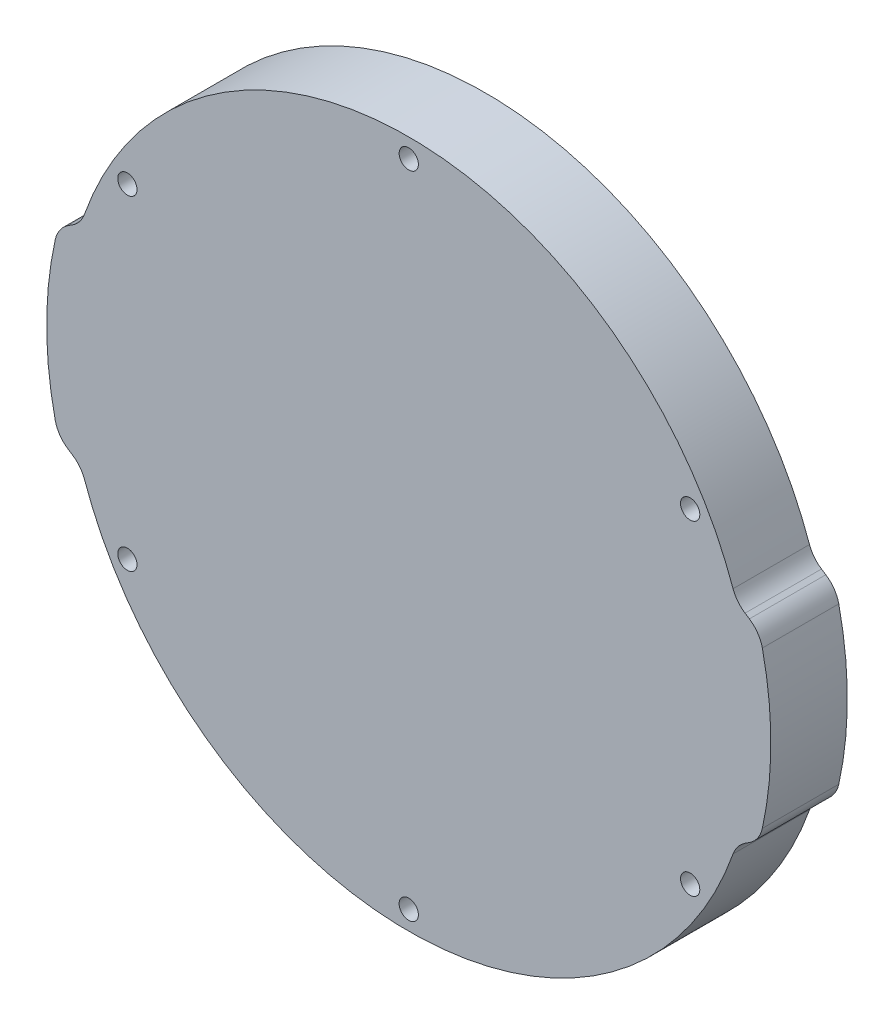
ISO-10303-21;
HEADER;
FILE_DESCRIPTION(('STEP AP214'),'2;1');
FILE_NAME('part.step','',(''),(''),'','','');
FILE_SCHEMA(('AUTOMOTIVE_DESIGN { 1 0 10303 214 1 1 1 1 }'));
ENDSEC;
DATA;
#1=APPLICATION_CONTEXT('core data for automotive mechanical design processes');
#2=APPLICATION_PROTOCOL_DEFINITION('international standard','automotive_design',2000,#1);
#3=PRODUCT_CONTEXT('',#1,'mechanical');
#4=PRODUCT('Part','Part','',(#3));
#5=PRODUCT_RELATED_PRODUCT_CATEGORY('part','',(#4));
#6=PRODUCT_DEFINITION_FORMATION('','',#4);
#7=PRODUCT_DEFINITION_CONTEXT('part definition',#1,'design');
#8=PRODUCT_DEFINITION('design','',#6,#7);
#9=PRODUCT_DEFINITION_SHAPE('','',#8);
#10=(LENGTH_UNIT() NAMED_UNIT(*) SI_UNIT(.MILLI.,.METRE.));
#11=(NAMED_UNIT(*) PLANE_ANGLE_UNIT() SI_UNIT($,.RADIAN.));
#12=(NAMED_UNIT(*) SI_UNIT($,.STERADIAN.) SOLID_ANGLE_UNIT());
#13=UNCERTAINTY_MEASURE_WITH_UNIT(LENGTH_MEASURE(1.E-05),#10,'distance_accuracy_value','');
#14=(GEOMETRIC_REPRESENTATION_CONTEXT(3) GLOBAL_UNCERTAINTY_ASSIGNED_CONTEXT((#13)) GLOBAL_UNIT_ASSIGNED_CONTEXT((#10,
#11,#12)) REPRESENTATION_CONTEXT('',''));
#15=CARTESIAN_POINT('',(0.,0.,0.));
#16=DIRECTION('',(0.,0.,1.));
#17=DIRECTION('',(1.,0.,0.));
#18=AXIS2_PLACEMENT_3D('',#15,#16,#17);
#19=CARTESIAN_POINT('',(0.,0.,12.7));
#20=DIRECTION('',(0.,0.,-1.));
#21=DIRECTION('',(-1.,0.,0.));
#22=AXIS2_PLACEMENT_3D('',#19,#20,#21);
#23=PLANE('',#22);
#24=CARTESIAN_POINT('',(5.42327943909187E-12,-53.975,12.7));
#25=DIRECTION('',(0.,0.,1.));
#26=DIRECTION('',(1.,0.,0.));
#27=AXIS2_PLACEMENT_3D('',#24,#25,#26);
#28=CIRCLE('',#27,1.6);
#29=CARTESIAN_POINT('',(1.60000000000542,-53.975,12.7));
#30=VERTEX_POINT('',#29);
#31=EDGE_CURVE('E497',#30,#30,#28,.T.);
#32=ORIENTED_EDGE('',*,*,#31,.F.);
#33=EDGE_LOOP('',(#32));
#34=FACE_BOUND('',#33,.T.);
#35=CARTESIAN_POINT('',(46.7437211692664,26.9875000000024,12.7));
#36=DIRECTION('',(0.,0.,1.));
#37=DIRECTION('',(1.,0.,0.));
#38=AXIS2_PLACEMENT_3D('',#35,#36,#37);
#39=CIRCLE('',#38,1.60000000000001);
#40=CARTESIAN_POINT('',(48.3437211692664,26.9875000000024,12.7));
#41=VERTEX_POINT('',#40);
#42=EDGE_CURVE('E313',#41,#41,#39,.T.);
#43=ORIENTED_EDGE('',*,*,#42,.F.);
#44=EDGE_LOOP('',(#43));
#45=FACE_BOUND('',#44,.T.);
#46=CARTESIAN_POINT('',(0.,53.975,12.7));
#47=DIRECTION('',(0.,0.,1.));
#48=DIRECTION('',(1.,0.,0.));
#49=AXIS2_PLACEMENT_3D('',#46,#47,#48);
#50=CIRCLE('',#49,1.6);
#51=CARTESIAN_POINT('',(1.6,53.975,12.7));
#52=VERTEX_POINT('',#51);
#53=EDGE_CURVE('E319',#52,#52,#50,.T.);
#54=ORIENTED_EDGE('',*,*,#53,.F.);
#55=EDGE_LOOP('',(#54));
#56=FACE_BOUND('',#55,.T.);
#57=CARTESIAN_POINT('',(0.,0.,12.7));
#58=DIRECTION('',(0.,0.,1.));
#59=DIRECTION('',(-1.,0.,0.));
#60=AXIS2_PLACEMENT_3D('',#57,#58,#59);
#61=CIRCLE('',#60,60.15);
#62=CARTESIAN_POINT('',(58.7341357738568,-12.97396604351,12.7));
#63=VERTEX_POINT('',#62);
#64=CARTESIAN_POINT('',(58.7341357738568,12.97396604351,12.7));
#65=VERTEX_POINT('',#64);
#66=EDGE_CURVE('E218',#63,#65,#61,.T.);
#67=ORIENTED_EDGE('',*,*,#66,.T.);
#68=CARTESIAN_POINT('',(53.8518302232453,11.8954983757203,12.7));
#69=DIRECTION('',(0.,0.,-1.));
#70=DIRECTION('',(-1.,0.,0.));
#71=AXIS2_PLACEMENT_3D('',#68,#69,#70);
#72=CIRCLE('',#71,5.);
#73=CARTESIAN_POINT('',(56.5773734681787,16.0873254260645,12.7));
#74=VERTEX_POINT('',#73);
#75=EDGE_CURVE('E255',#65,#74,#72,.F.);
#76=ORIENTED_EDGE('',*,*,#75,.T.);
#77=DIRECTION('',(-0.838365410068851,0.545108648986684,0.));
#78=VECTOR('',#77,1.);
#79=CARTESIAN_POINT('',(58.2496566513486,15.,12.7));
#80=LINE('',#79,#78);
#81=CARTESIAN_POINT('',(55.8597455361239,16.5539300686456,12.7));
#82=VERTEX_POINT('',#81);
#83=EDGE_CURVE('E344',#74,#82,#80,.T.);
#84=ORIENTED_EDGE('',*,*,#83,.T.);
#85=CARTESIAN_POINT('',(58.5852887810573,20.7457571189899,12.7));
#86=DIRECTION('',(0.,0.,-1.));
#87=DIRECTION('',(-1.,0.,0.));
#88=AXIS2_PLACEMENT_3D('',#85,#86,#87);
#89=CIRCLE('',#88,5.);
#90=CARTESIAN_POINT('',(53.87207166271,19.0767501102216,12.7));
#91=VERTEX_POINT('',#90);
#92=EDGE_CURVE('E171',#82,#91,#89,.T.);
#93=ORIENTED_EDGE('',*,*,#92,.T.);
#94=CARTESIAN_POINT('',(0.,0.,12.7));
#95=DIRECTION('',(0.,0.,1.));
#96=DIRECTION('',(1.,0.,0.));
#97=AXIS2_PLACEMENT_3D('',#94,#95,#96);
#98=CIRCLE('',#97,57.15);
#99=CARTESIAN_POINT('',(-53.87207166271,19.0767501102216,12.7));
#100=VERTEX_POINT('',#99);
#101=EDGE_CURVE('E181',#91,#100,#98,.T.);
#102=ORIENTED_EDGE('',*,*,#101,.T.);
#103=CARTESIAN_POINT('',(-58.5852887810573,20.7457571189899,12.7));
#104=DIRECTION('',(0.,0.,-1.));
#105=DIRECTION('',(-1.,0.,0.));
#106=AXIS2_PLACEMENT_3D('',#103,#104,#105);
#107=CIRCLE('',#106,5.);
#108=CARTESIAN_POINT('',(-55.8597455361239,16.5539300686456,12.7));
#109=VERTEX_POINT('',#108);
#110=EDGE_CURVE('E11',#100,#109,#107,.T.);
#111=ORIENTED_EDGE('',*,*,#110,.T.);
#112=DIRECTION('',(-0.838365410068851,-0.545108648986684,0.));
#113=VECTOR('',#112,1.);
#114=CARTESIAN_POINT('',(-58.2496566513486,15.,12.7));
#115=LINE('',#114,#113);
#116=CARTESIAN_POINT('',(-56.5773734681787,16.0873254260645,12.7));
#117=VERTEX_POINT('',#116);
#118=EDGE_CURVE('E305',#109,#117,#115,.T.);
#119=ORIENTED_EDGE('',*,*,#118,.T.);
#120=CARTESIAN_POINT('',(-53.8518302232453,11.8954983757203,12.7));
#121=DIRECTION('',(0.,0.,-1.));
#122=DIRECTION('',(-1.,0.,0.));
#123=AXIS2_PLACEMENT_3D('',#120,#121,#122);
#124=CIRCLE('',#123,5.);
#125=CARTESIAN_POINT('',(-58.7341357738568,12.97396604351,12.7));
#126=VERTEX_POINT('',#125);
#127=EDGE_CURVE('E246',#117,#126,#124,.F.);
#128=ORIENTED_EDGE('',*,*,#127,.T.);
#129=CARTESIAN_POINT('',(0.,0.,12.7));
#130=DIRECTION('',(0.,0.,1.));
#131=DIRECTION('',(1.,0.,0.));
#132=AXIS2_PLACEMENT_3D('',#129,#130,#131);
#133=CIRCLE('',#132,60.15);
#134=CARTESIAN_POINT('',(-58.7341357738568,-12.97396604351,12.7));
#135=VERTEX_POINT('',#134);
#136=EDGE_CURVE('E308',#126,#135,#133,.T.);
#137=ORIENTED_EDGE('',*,*,#136,.T.);
#138=CARTESIAN_POINT('',(-53.8518302232453,-11.8954983757203,12.7));
#139=DIRECTION('',(0.,0.,-1.));
#140=DIRECTION('',(-1.,0.,0.));
#141=AXIS2_PLACEMENT_3D('',#138,#139,#140);
#142=CIRCLE('',#141,5.);
#143=CARTESIAN_POINT('',(-56.5773734681787,-16.0873254260645,12.7));
#144=VERTEX_POINT('',#143);
#145=EDGE_CURVE('E249',#135,#144,#142,.F.);
#146=ORIENTED_EDGE('',*,*,#145,.T.);
#147=DIRECTION('',(0.838365410068851,-0.545108648986684,0.));
#148=VECTOR('',#147,1.);
#149=CARTESIAN_POINT('',(-58.2496566513486,-15.,12.7));
#150=LINE('',#149,#148);
#151=CARTESIAN_POINT('',(-55.8597455361239,-16.5539300686456,12.7));
#152=VERTEX_POINT('',#151);
#153=EDGE_CURVE('E353',#144,#152,#150,.T.);
#154=ORIENTED_EDGE('',*,*,#153,.T.);
#155=CARTESIAN_POINT('',(-58.5852887810573,-20.7457571189899,12.7));
#156=DIRECTION('',(0.,0.,-1.));
#157=DIRECTION('',(-1.,0.,0.));
#158=AXIS2_PLACEMENT_3D('',#155,#156,#157);
#159=CIRCLE('',#158,5.);
#160=CARTESIAN_POINT('',(-53.87207166271,-19.0767501102216,12.7));
#161=VERTEX_POINT('',#160);
#162=EDGE_CURVE('E300',#152,#161,#159,.T.);
#163=ORIENTED_EDGE('',*,*,#162,.T.);
#164=CARTESIAN_POINT('',(0.,0.,12.7));
#165=DIRECTION('',(0.,0.,1.));
#166=DIRECTION('',(1.,0.,0.));
#167=AXIS2_PLACEMENT_3D('',#164,#165,#166);
#168=CIRCLE('',#167,57.15);
#169=CARTESIAN_POINT('',(53.87207166271,-19.0767501102216,12.7));
#170=VERTEX_POINT('',#169);
#171=EDGE_CURVE('E357',#161,#170,#168,.T.);
#172=ORIENTED_EDGE('',*,*,#171,.T.);
#173=CARTESIAN_POINT('',(58.5852887810573,-20.7457571189899,12.7));
#174=DIRECTION('',(0.,0.,-1.));
#175=DIRECTION('',(-1.,0.,0.));
#176=AXIS2_PLACEMENT_3D('',#173,#174,#175);
#177=CIRCLE('',#176,5.);
#178=CARTESIAN_POINT('',(55.8597455361239,-16.5539300686456,12.7));
#179=VERTEX_POINT('',#178);
#180=EDGE_CURVE('E68',#170,#179,#177,.T.);
#181=ORIENTED_EDGE('',*,*,#180,.T.);
#182=DIRECTION('',(0.838365410068851,0.545108648986684,0.));
#183=VECTOR('',#182,1.);
#184=CARTESIAN_POINT('',(58.2496566513486,-15.,12.7));
#185=LINE('',#184,#183);
#186=CARTESIAN_POINT('',(56.5773734681787,-16.0873254260645,12.7));
#187=VERTEX_POINT('',#186);
#188=EDGE_CURVE('E220',#179,#187,#185,.T.);
#189=ORIENTED_EDGE('',*,*,#188,.T.);
#190=CARTESIAN_POINT('',(53.8518302232453,-11.8954983757203,12.7));
#191=DIRECTION('',(0.,0.,-1.));
#192=DIRECTION('',(-1.,0.,0.));
#193=AXIS2_PLACEMENT_3D('',#190,#191,#192);
#194=CIRCLE('',#193,5.);
#195=EDGE_CURVE('E252',#187,#63,#194,.F.);
#196=ORIENTED_EDGE('',*,*,#195,.T.);
#197=EDGE_LOOP('',(#67,#76,#84,#93,#102,#111,#119,#128,#137,#146,#154,#163,#172,#181,#189,#196));
#198=FACE_BOUND('',#197,.T.);
#199=CARTESIAN_POINT('',(-46.743721169261,-26.9875000000024,12.7));
#200=DIRECTION('',(0.,0.,1.));
#201=DIRECTION('',(1.,0.,0.));
#202=AXIS2_PLACEMENT_3D('',#199,#200,#201);
#203=CIRCLE('',#202,1.6);
#204=CARTESIAN_POINT('',(-45.143721169261,-26.9875000000024,12.7));
#205=VERTEX_POINT('',#204);
#206=EDGE_CURVE('E312',#205,#205,#203,.T.);
#207=ORIENTED_EDGE('',*,*,#206,.F.);
#208=EDGE_LOOP('',(#207));
#209=FACE_BOUND('',#208,.T.);
#210=CARTESIAN_POINT('',(46.7437211692692,-26.9874999999976,12.7));
#211=DIRECTION('',(0.,0.,1.));
#212=DIRECTION('',(1.,0.,0.));
#213=AXIS2_PLACEMENT_3D('',#210,#211,#212);
#214=CIRCLE('',#213,1.6);
#215=CARTESIAN_POINT('',(48.3437211692691,-26.9874999999976,12.7));
#216=VERTEX_POINT('',#215);
#217=EDGE_CURVE('E323',#216,#216,#214,.T.);
#218=ORIENTED_EDGE('',*,*,#217,.F.);
#219=EDGE_LOOP('',(#218));
#220=FACE_BOUND('',#219,.T.);
#221=CARTESIAN_POINT('',(-46.7437211692637,26.9874999999976,12.7));
#222=DIRECTION('',(0.,0.,1.));
#223=DIRECTION('',(1.,0.,0.));
#224=AXIS2_PLACEMENT_3D('',#221,#222,#223);
#225=CIRCLE('',#224,1.6);
#226=CARTESIAN_POINT('',(-45.1437211692637,26.9874999999976,12.7));
#227=VERTEX_POINT('',#226);
#228=EDGE_CURVE('E491',#227,#227,#225,.T.);
#229=ORIENTED_EDGE('',*,*,#228,.F.);
#230=EDGE_LOOP('',(#229));
#231=FACE_BOUND('',#230,.T.);
#232=ADVANCED_FACE('F45',(#34,#45,#56,#198,#209,#220,#231),#23,.F.);
#233=CARTESIAN_POINT('',(0.,0.,0.));
#234=DIRECTION('',(0.,0.,-1.));
#235=DIRECTION('',(-1.,0.,0.));
#236=AXIS2_PLACEMENT_3D('',#233,#234,#235);
#237=PLANE('',#236);
#238=CARTESIAN_POINT('',(5.42327943909187E-12,-53.975,0.));
#239=DIRECTION('',(0.,0.,1.));
#240=DIRECTION('',(1.,0.,0.));
#241=AXIS2_PLACEMENT_3D('',#238,#239,#240);
#242=CIRCLE('',#241,1.6);
#243=CARTESIAN_POINT('',(1.60000000000542,-53.975,0.));
#244=VERTEX_POINT('',#243);
#245=EDGE_CURVE('E494',#244,#244,#242,.T.);
#246=ORIENTED_EDGE('',*,*,#245,.T.);
#247=EDGE_LOOP('',(#246));
#248=FACE_BOUND('',#247,.T.);
#249=CARTESIAN_POINT('',(46.7437211692664,26.9875000000024,0.));
#250=DIRECTION('',(0.,0.,1.));
#251=DIRECTION('',(1.,0.,0.));
#252=AXIS2_PLACEMENT_3D('',#249,#250,#251);
#253=CIRCLE('',#252,1.60000000000001);
#254=CARTESIAN_POINT('',(48.3437211692664,26.9875000000024,0.));
#255=VERTEX_POINT('',#254);
#256=EDGE_CURVE('E321',#255,#255,#253,.T.);
#257=ORIENTED_EDGE('',*,*,#256,.T.);
#258=EDGE_LOOP('',(#257));
#259=FACE_BOUND('',#258,.T.);
#260=CARTESIAN_POINT('',(0.,53.975,0.));
#261=DIRECTION('',(0.,0.,1.));
#262=DIRECTION('',(1.,0.,0.));
#263=AXIS2_PLACEMENT_3D('',#260,#261,#262);
#264=CIRCLE('',#263,1.6);
#265=CARTESIAN_POINT('',(1.6,53.975,0.));
#266=VERTEX_POINT('',#265);
#267=EDGE_CURVE('E316',#266,#266,#264,.T.);
#268=ORIENTED_EDGE('',*,*,#267,.T.);
#269=EDGE_LOOP('',(#268));
#270=FACE_BOUND('',#269,.T.);
#271=DIRECTION('',(-0.838365410068851,0.545108648986684,0.));
#272=VECTOR('',#271,1.);
#273=CARTESIAN_POINT('',(58.2496566513486,15.,0.));
#274=LINE('',#273,#272);
#275=CARTESIAN_POINT('',(56.5773734681787,16.0873254260645,0.));
#276=VERTEX_POINT('',#275);
#277=CARTESIAN_POINT('',(55.8597455361239,16.5539300686456,0.));
#278=VERTEX_POINT('',#277);
#279=EDGE_CURVE('E191',#276,#278,#274,.T.);
#280=ORIENTED_EDGE('',*,*,#279,.F.);
#281=CARTESIAN_POINT('',(53.8518302232453,11.8954983757203,0.));
#282=DIRECTION('',(0.,0.,-1.));
#283=DIRECTION('',(-1.,0.,0.));
#284=AXIS2_PLACEMENT_3D('',#281,#282,#283);
#285=CIRCLE('',#284,5.);
#286=CARTESIAN_POINT('',(58.7341357738568,12.97396604351,0.));
#287=VERTEX_POINT('',#286);
#288=EDGE_CURVE('E236',#276,#287,#285,.T.);
#289=ORIENTED_EDGE('',*,*,#288,.T.);
#290=CARTESIAN_POINT('',(0.,0.,0.));
#291=DIRECTION('',(0.,0.,1.));
#292=DIRECTION('',(-1.,0.,0.));
#293=AXIS2_PLACEMENT_3D('',#290,#291,#292);
#294=CIRCLE('',#293,60.15);
#295=CARTESIAN_POINT('',(58.7341357738568,-12.97396604351,0.));
#296=VERTEX_POINT('',#295);
#297=EDGE_CURVE('E200',#296,#287,#294,.T.);
#298=ORIENTED_EDGE('',*,*,#297,.F.);
#299=CARTESIAN_POINT('',(53.8518302232453,-11.8954983757203,0.));
#300=DIRECTION('',(0.,0.,-1.));
#301=DIRECTION('',(-1.,0.,0.));
#302=AXIS2_PLACEMENT_3D('',#299,#300,#301);
#303=CIRCLE('',#302,5.);
#304=CARTESIAN_POINT('',(56.5773734681787,-16.0873254260645,0.));
#305=VERTEX_POINT('',#304);
#306=EDGE_CURVE('E233',#296,#305,#303,.T.);
#307=ORIENTED_EDGE('',*,*,#306,.T.);
#308=DIRECTION('',(0.838365410068851,0.545108648986684,0.));
#309=VECTOR('',#308,1.);
#310=CARTESIAN_POINT('',(58.2496566513486,-15.,0.));
#311=LINE('',#310,#309);
#312=CARTESIAN_POINT('',(55.8597455361239,-16.5539300686456,0.));
#313=VERTEX_POINT('',#312);
#314=EDGE_CURVE('E215',#313,#305,#311,.T.);
#315=ORIENTED_EDGE('',*,*,#314,.F.);
#316=CARTESIAN_POINT('',(58.5852887810573,-20.7457571189899,0.));
#317=DIRECTION('',(0.,0.,-1.));
#318=DIRECTION('',(-1.,0.,0.));
#319=AXIS2_PLACEMENT_3D('',#316,#317,#318);
#320=CIRCLE('',#319,5.);
#321=CARTESIAN_POINT('',(53.87207166271,-19.0767501102216,0.));
#322=VERTEX_POINT('',#321);
#323=EDGE_CURVE('E292',#313,#322,#320,.F.);
#324=ORIENTED_EDGE('',*,*,#323,.T.);
#325=CARTESIAN_POINT('',(0.,0.,0.));
#326=DIRECTION('',(0.,0.,1.));
#327=DIRECTION('',(1.,0.,0.));
#328=AXIS2_PLACEMENT_3D('',#325,#326,#327);
#329=CIRCLE('',#328,57.15);
#330=CARTESIAN_POINT('',(-53.87207166271,-19.0767501102216,0.));
#331=VERTEX_POINT('',#330);
#332=EDGE_CURVE('E211',#331,#322,#329,.T.);
#333=ORIENTED_EDGE('',*,*,#332,.F.);
#334=CARTESIAN_POINT('',(-58.5852887810573,-20.7457571189899,0.));
#335=DIRECTION('',(0.,0.,-1.));
#336=DIRECTION('',(-1.,0.,0.));
#337=AXIS2_PLACEMENT_3D('',#334,#335,#336);
#338=CIRCLE('',#337,5.);
#339=CARTESIAN_POINT('',(-55.8597455361239,-16.5539300686456,0.));
#340=VERTEX_POINT('',#339);
#341=EDGE_CURVE('E297',#331,#340,#338,.F.);
#342=ORIENTED_EDGE('',*,*,#341,.T.);
#343=DIRECTION('',(0.838365410068851,-0.545108648986684,0.));
#344=VECTOR('',#343,1.);
#345=CARTESIAN_POINT('',(-58.2496566513486,-15.,0.));
#346=LINE('',#345,#344);
#347=CARTESIAN_POINT('',(-56.5773734681787,-16.0873254260645,0.));
#348=VERTEX_POINT('',#347);
#349=EDGE_CURVE('E207',#348,#340,#346,.T.);
#350=ORIENTED_EDGE('',*,*,#349,.F.);
#351=CARTESIAN_POINT('',(-53.8518302232453,-11.8954983757203,0.));
#352=DIRECTION('',(0.,0.,-1.));
#353=DIRECTION('',(-1.,0.,0.));
#354=AXIS2_PLACEMENT_3D('',#351,#352,#353);
#355=CIRCLE('',#354,5.);
#356=CARTESIAN_POINT('',(-58.7341357738568,-12.97396604351,0.));
#357=VERTEX_POINT('',#356);
#358=EDGE_CURVE('E230',#348,#357,#355,.T.);
#359=ORIENTED_EDGE('',*,*,#358,.T.);
#360=CARTESIAN_POINT('',(0.,0.,0.));
#361=DIRECTION('',(0.,0.,1.));
#362=DIRECTION('',(1.,0.,0.));
#363=AXIS2_PLACEMENT_3D('',#360,#361,#362);
#364=CIRCLE('',#363,60.15);
#365=CARTESIAN_POINT('',(-58.7341357738568,12.97396604351,0.));
#366=VERTEX_POINT('',#365);
#367=EDGE_CURVE('E197',#366,#357,#364,.T.);
#368=ORIENTED_EDGE('',*,*,#367,.F.);
#369=CARTESIAN_POINT('',(-53.8518302232453,11.8954983757203,0.));
#370=DIRECTION('',(0.,0.,-1.));
#371=DIRECTION('',(-1.,0.,0.));
#372=AXIS2_PLACEMENT_3D('',#369,#370,#371);
#373=CIRCLE('',#372,5.);
#374=CARTESIAN_POINT('',(-56.5773734681787,16.0873254260645,0.));
#375=VERTEX_POINT('',#374);
#376=EDGE_CURVE('E227',#366,#375,#373,.T.);
#377=ORIENTED_EDGE('',*,*,#376,.T.);
#378=DIRECTION('',(-0.838365410068851,-0.545108648986684,0.));
#379=VECTOR('',#378,1.);
#380=CARTESIAN_POINT('',(-58.2496566513486,15.,0.));
#381=LINE('',#380,#379);
#382=CARTESIAN_POINT('',(-55.8597455361239,16.5539300686456,0.));
#383=VERTEX_POINT('',#382);
#384=EDGE_CURVE('E190',#383,#375,#381,.T.);
#385=ORIENTED_EDGE('',*,*,#384,.F.);
#386=CARTESIAN_POINT('',(-58.5852887810573,20.7457571189899,0.));
#387=DIRECTION('',(0.,0.,-1.));
#388=DIRECTION('',(-1.,0.,0.));
#389=AXIS2_PLACEMENT_3D('',#386,#387,#388);
#390=CIRCLE('',#389,5.);
#391=CARTESIAN_POINT('',(-53.87207166271,19.0767501102216,0.));
#392=VERTEX_POINT('',#391);
#393=EDGE_CURVE('E54',#383,#392,#390,.F.);
#394=ORIENTED_EDGE('',*,*,#393,.T.);
#395=CARTESIAN_POINT('',(0.,0.,0.));
#396=DIRECTION('',(0.,0.,1.));
#397=DIRECTION('',(1.,0.,0.));
#398=AXIS2_PLACEMENT_3D('',#395,#396,#397);
#399=CIRCLE('',#398,57.15);
#400=CARTESIAN_POINT('',(53.87207166271,19.0767501102216,0.));
#401=VERTEX_POINT('',#400);
#402=EDGE_CURVE('E178',#401,#392,#399,.T.);
#403=ORIENTED_EDGE('',*,*,#402,.F.);
#404=CARTESIAN_POINT('',(58.5852887810573,20.7457571189899,0.));
#405=DIRECTION('',(0.,0.,-1.));
#406=DIRECTION('',(-1.,0.,0.));
#407=AXIS2_PLACEMENT_3D('',#404,#405,#406);
#408=CIRCLE('',#407,5.);
#409=EDGE_CURVE('E160',#401,#278,#408,.F.);
#410=ORIENTED_EDGE('',*,*,#409,.T.);
#411=EDGE_LOOP('',(#280,#289,#298,#307,#315,#324,#333,#342,#350,#359,#368,#377,#385,#394,#403,#410));
#412=FACE_BOUND('',#411,.T.);
#413=CARTESIAN_POINT('',(-46.743721169261,-26.9875000000024,0.));
#414=DIRECTION('',(0.,0.,1.));
#415=DIRECTION('',(1.,0.,0.));
#416=AXIS2_PLACEMENT_3D('',#413,#414,#415);
#417=CIRCLE('',#416,1.6);
#418=CARTESIAN_POINT('',(-45.143721169261,-26.9875000000024,0.));
#419=VERTEX_POINT('',#418);
#420=EDGE_CURVE('E310',#419,#419,#417,.T.);
#421=ORIENTED_EDGE('',*,*,#420,.T.);
#422=EDGE_LOOP('',(#421));
#423=FACE_BOUND('',#422,.T.);
#424=CARTESIAN_POINT('',(46.7437211692692,-26.9874999999976,0.));
#425=DIRECTION('',(0.,0.,1.));
#426=DIRECTION('',(1.,0.,0.));
#427=AXIS2_PLACEMENT_3D('',#424,#425,#426);
#428=CIRCLE('',#427,1.6);
#429=CARTESIAN_POINT('',(48.3437211692691,-26.9874999999976,0.));
#430=VERTEX_POINT('',#429);
#431=EDGE_CURVE('E331',#430,#430,#428,.T.);
#432=ORIENTED_EDGE('',*,*,#431,.T.);
#433=EDGE_LOOP('',(#432));
#434=FACE_BOUND('',#433,.T.);
#435=CARTESIAN_POINT('',(-46.7437211692637,26.9874999999976,0.));
#436=DIRECTION('',(0.,0.,1.));
#437=DIRECTION('',(1.,0.,0.));
#438=AXIS2_PLACEMENT_3D('',#435,#436,#437);
#439=CIRCLE('',#438,1.6);
#440=CARTESIAN_POINT('',(-45.1437211692637,26.9874999999976,0.));
#441=VERTEX_POINT('',#440);
#442=EDGE_CURVE('E489',#441,#441,#439,.T.);
#443=ORIENTED_EDGE('',*,*,#442,.T.);
#444=EDGE_LOOP('',(#443));
#445=FACE_BOUND('',#444,.T.);
#446=ADVANCED_FACE('F186',(#248,#259,#270,#412,#423,#434,#445),#237,.T.);
#447=CARTESIAN_POINT('',(0.,0.,12.7));
#448=DIRECTION('',(0.,0.,-1.));
#449=DIRECTION('',(-1.,0.,0.));
#450=AXIS2_PLACEMENT_3D('',#447,#448,#449);
#451=CYLINDRICAL_SURFACE('',#450,60.15);
#452=ORIENTED_EDGE('',*,*,#297,.T.);
#453=DIRECTION('',(0.,0.,-1.));
#454=VECTOR('',#453,1.);
#455=CARTESIAN_POINT('',(58.7341357738569,12.97396604351,12.7));
#456=LINE('',#455,#454);
#457=EDGE_CURVE('E243',#287,#65,#456,.F.);
#458=ORIENTED_EDGE('',*,*,#457,.T.);
#459=ORIENTED_EDGE('',*,*,#66,.F.);
#460=DIRECTION('',(0.,0.,-1.));
#461=VECTOR('',#460,1.);
#462=CARTESIAN_POINT('',(58.7341357738569,-12.97396604351,12.7));
#463=LINE('',#462,#461);
#464=EDGE_CURVE('E239',#63,#296,#463,.T.);
#465=ORIENTED_EDGE('',*,*,#464,.T.);
#466=EDGE_LOOP('',(#452,#458,#459,#465));
#467=FACE_BOUND('',#466,.T.);
#468=ADVANCED_FACE('F366',(#467),#451,.T.);
#469=CARTESIAN_POINT('',(58.2496566513486,15.,12.7));
#470=DIRECTION('',(-0.545108648986684,-0.838365410068851,0.));
#471=DIRECTION('',(0.838365410068851,-0.545108648986684,0.));
#472=AXIS2_PLACEMENT_3D('',#469,#470,#471);
#473=PLANE('',#472);
#474=ORIENTED_EDGE('',*,*,#279,.T.);
#475=DIRECTION('',(0.,0.,1.));
#476=VECTOR('',#475,1.);
#477=CARTESIAN_POINT('',(55.8597455361239,16.5539300686456,12.7));
#478=LINE('',#477,#476);
#479=EDGE_CURVE('E165',#278,#82,#478,.T.);
#480=ORIENTED_EDGE('',*,*,#479,.T.);
#481=ORIENTED_EDGE('',*,*,#83,.F.);
#482=DIRECTION('',(0.,0.,-1.));
#483=VECTOR('',#482,1.);
#484=CARTESIAN_POINT('',(56.5773734681787,16.0873254260645,12.7));
#485=LINE('',#484,#483);
#486=EDGE_CURVE('E183',#74,#276,#485,.T.);
#487=ORIENTED_EDGE('',*,*,#486,.T.);
#488=EDGE_LOOP('',(#474,#480,#481,#487));
#489=FACE_BOUND('',#488,.T.);
#490=ADVANCED_FACE('F376',(#489),#473,.F.);
#491=CARTESIAN_POINT('',(0.,0.,12.7));
#492=DIRECTION('',(0.,0.,-1.));
#493=DIRECTION('',(-1.,0.,0.));
#494=AXIS2_PLACEMENT_3D('',#491,#492,#493);
#495=CYLINDRICAL_SURFACE('',#494,57.15);
#496=ORIENTED_EDGE('',*,*,#101,.F.);
#497=DIRECTION('',(0.,0.,-1.));
#498=VECTOR('',#497,1.);
#499=CARTESIAN_POINT('',(53.87207166271,19.0767501102216,12.7));
#500=LINE('',#499,#498);
#501=EDGE_CURVE('E164',#91,#401,#500,.T.);
#502=ORIENTED_EDGE('',*,*,#501,.T.);
#503=ORIENTED_EDGE('',*,*,#402,.T.);
#504=DIRECTION('',(0.,0.,-1.));
#505=VECTOR('',#504,1.);
#506=CARTESIAN_POINT('',(-53.87207166271,19.0767501102216,12.7));
#507=LINE('',#506,#505);
#508=EDGE_CURVE('E184',#392,#100,#507,.F.);
#509=ORIENTED_EDGE('',*,*,#508,.T.);
#510=EDGE_LOOP('',(#496,#502,#503,#509));
#511=FACE_BOUND('',#510,.T.);
#512=ADVANCED_FACE('F177',(#511),#495,.T.);
#513=CARTESIAN_POINT('',(-58.2496566513486,15.,12.7));
#514=DIRECTION('',(0.545108648986684,-0.838365410068851,0.));
#515=DIRECTION('',(0.838365410068851,0.545108648986684,0.));
#516=AXIS2_PLACEMENT_3D('',#513,#514,#515);
#517=PLANE('',#516);
#518=ORIENTED_EDGE('',*,*,#118,.F.);
#519=DIRECTION('',(0.,0.,1.));
#520=VECTOR('',#519,1.);
#521=CARTESIAN_POINT('',(-55.8597455361239,16.5539300686456,0.));
#522=LINE('',#521,#520);
#523=EDGE_CURVE('E172',#109,#383,#522,.F.);
#524=ORIENTED_EDGE('',*,*,#523,.T.);
#525=ORIENTED_EDGE('',*,*,#384,.T.);
#526=DIRECTION('',(0.,0.,-1.));
#527=VECTOR('',#526,1.);
#528=CARTESIAN_POINT('',(-56.5773734681787,16.0873254260645,12.7));
#529=LINE('',#528,#527);
#530=EDGE_CURVE('E285',#375,#117,#529,.F.);
#531=ORIENTED_EDGE('',*,*,#530,.T.);
#532=EDGE_LOOP('',(#518,#524,#525,#531));
#533=FACE_BOUND('',#532,.T.);
#534=ADVANCED_FACE('F383',(#533),#517,.F.);
#535=CARTESIAN_POINT('',(0.,0.,12.7));
#536=DIRECTION('',(0.,0.,-1.));
#537=DIRECTION('',(-1.,0.,0.));
#538=AXIS2_PLACEMENT_3D('',#535,#536,#537);
#539=CYLINDRICAL_SURFACE('',#538,60.15);
#540=ORIENTED_EDGE('',*,*,#367,.T.);
#541=DIRECTION('',(0.,0.,-1.));
#542=VECTOR('',#541,1.);
#543=CARTESIAN_POINT('',(-58.7341357738569,-12.97396604351,12.7));
#544=LINE('',#543,#542);
#545=EDGE_CURVE('E282',#357,#135,#544,.F.);
#546=ORIENTED_EDGE('',*,*,#545,.T.);
#547=ORIENTED_EDGE('',*,*,#136,.F.);
#548=DIRECTION('',(0.,0.,-1.));
#549=VECTOR('',#548,1.);
#550=CARTESIAN_POINT('',(-58.7341357738569,12.97396604351,12.7));
#551=LINE('',#550,#549);
#552=EDGE_CURVE('E278',#126,#366,#551,.T.);
#553=ORIENTED_EDGE('',*,*,#552,.T.);
#554=EDGE_LOOP('',(#540,#546,#547,#553));
#555=FACE_BOUND('',#554,.T.);
#556=ADVANCED_FACE('F410',(#555),#539,.T.);
#557=CARTESIAN_POINT('',(-58.2496566513486,-15.,12.7));
#558=DIRECTION('',(0.545108648986684,0.838365410068851,0.));
#559=DIRECTION('',(-0.838365410068851,0.545108648986684,0.));
#560=AXIS2_PLACEMENT_3D('',#557,#558,#559);
#561=PLANE('',#560);
#562=ORIENTED_EDGE('',*,*,#349,.T.);
#563=DIRECTION('',(0.,0.,1.));
#564=VECTOR('',#563,1.);
#565=CARTESIAN_POINT('',(-55.8597455361239,-16.5539300686456,12.7));
#566=LINE('',#565,#564);
#567=EDGE_CURVE('E275',#340,#152,#566,.T.);
#568=ORIENTED_EDGE('',*,*,#567,.T.);
#569=ORIENTED_EDGE('',*,*,#153,.F.);
#570=DIRECTION('',(0.,0.,-1.));
#571=VECTOR('',#570,1.);
#572=CARTESIAN_POINT('',(-56.5773734681787,-16.0873254260645,12.7));
#573=LINE('',#572,#571);
#574=EDGE_CURVE('E271',#144,#348,#573,.T.);
#575=ORIENTED_EDGE('',*,*,#574,.T.);
#576=EDGE_LOOP('',(#562,#568,#569,#575));
#577=FACE_BOUND('',#576,.T.);
#578=ADVANCED_FACE('F406',(#577),#561,.F.);
#579=CARTESIAN_POINT('',(0.,0.,12.7));
#580=DIRECTION('',(0.,0.,-1.));
#581=DIRECTION('',(-1.,0.,0.));
#582=AXIS2_PLACEMENT_3D('',#579,#580,#581);
#583=CYLINDRICAL_SURFACE('',#582,57.15);
#584=ORIENTED_EDGE('',*,*,#332,.T.);
#585=DIRECTION('',(0.,0.,-1.));
#586=VECTOR('',#585,1.);
#587=CARTESIAN_POINT('',(53.87207166271,-19.0767501102216,12.7));
#588=LINE('',#587,#586);
#589=EDGE_CURVE('E268',#322,#170,#588,.F.);
#590=ORIENTED_EDGE('',*,*,#589,.T.);
#591=ORIENTED_EDGE('',*,*,#171,.F.);
#592=DIRECTION('',(0.,0.,-1.));
#593=VECTOR('',#592,1.);
#594=CARTESIAN_POINT('',(-53.87207166271,-19.0767501102216,12.7));
#595=LINE('',#594,#593);
#596=EDGE_CURVE('E264',#161,#331,#595,.T.);
#597=ORIENTED_EDGE('',*,*,#596,.T.);
#598=EDGE_LOOP('',(#584,#590,#591,#597));
#599=FACE_BOUND('',#598,.T.);
#600=ADVANCED_FACE('F403',(#599),#583,.T.);
#601=CARTESIAN_POINT('',(58.2496566513486,-15.,12.7));
#602=DIRECTION('',(-0.545108648986684,0.838365410068851,0.));
#603=DIRECTION('',(-0.838365410068851,-0.545108648986684,0.));
#604=AXIS2_PLACEMENT_3D('',#601,#602,#603);
#605=PLANE('',#604);
#606=ORIENTED_EDGE('',*,*,#314,.T.);
#607=DIRECTION('',(0.,0.,-1.));
#608=VECTOR('',#607,1.);
#609=CARTESIAN_POINT('',(56.5773734681787,-16.0873254260645,12.7));
#610=LINE('',#609,#608);
#611=EDGE_CURVE('E61',#305,#187,#610,.F.);
#612=ORIENTED_EDGE('',*,*,#611,.T.);
#613=ORIENTED_EDGE('',*,*,#188,.F.);
#614=DIRECTION('',(0.,0.,1.));
#615=VECTOR('',#614,1.);
#616=CARTESIAN_POINT('',(55.8597455361239,-16.5539300686456,0.));
#617=LINE('',#616,#615);
#618=EDGE_CURVE('E258',#179,#313,#617,.F.);
#619=ORIENTED_EDGE('',*,*,#618,.T.);
#620=EDGE_LOOP('',(#606,#612,#613,#619));
#621=FACE_BOUND('',#620,.T.);
#622=ADVANCED_FACE('F400',(#621),#605,.F.);
#623=CARTESIAN_POINT('',(0.,53.975,12.7));
#624=DIRECTION('',(0.,0.,-1.));
#625=DIRECTION('',(-1.,0.,0.));
#626=AXIS2_PLACEMENT_3D('',#623,#624,#625);
#627=CYLINDRICAL_SURFACE('',#626,1.6);
#628=ORIENTED_EDGE('',*,*,#53,.T.);
#629=EDGE_LOOP('',(#628));
#630=FACE_BOUND('',#629,.T.);
#631=ORIENTED_EDGE('',*,*,#267,.F.);
#632=EDGE_LOOP('',(#631));
#633=FACE_BOUND('',#632,.T.);
#634=ADVANCED_FACE('F397',(#630,#633),#627,.F.);
#635=CARTESIAN_POINT('',(-46.743721169261,-26.9875000000024,12.7));
#636=DIRECTION('',(0.,0.,-1.));
#637=DIRECTION('',(-1.,0.,0.));
#638=AXIS2_PLACEMENT_3D('',#635,#636,#637);
#639=CYLINDRICAL_SURFACE('',#638,1.6);
#640=ORIENTED_EDGE('',*,*,#206,.T.);
#641=EDGE_LOOP('',(#640));
#642=FACE_BOUND('',#641,.T.);
#643=ORIENTED_EDGE('',*,*,#420,.F.);
#644=EDGE_LOOP('',(#643));
#645=FACE_BOUND('',#644,.T.);
#646=ADVANCED_FACE('F472',(#642,#645),#639,.F.);
#647=CARTESIAN_POINT('',(46.7437211692664,26.9875000000024,12.7));
#648=DIRECTION('',(0.,0.,-1.));
#649=DIRECTION('',(-1.,0.,0.));
#650=AXIS2_PLACEMENT_3D('',#647,#648,#649);
#651=CYLINDRICAL_SURFACE('',#650,1.60000000000001);
#652=ORIENTED_EDGE('',*,*,#42,.T.);
#653=EDGE_LOOP('',(#652));
#654=FACE_BOUND('',#653,.T.);
#655=ORIENTED_EDGE('',*,*,#256,.F.);
#656=EDGE_LOOP('',(#655));
#657=FACE_BOUND('',#656,.T.);
#658=ADVANCED_FACE('F469',(#654,#657),#651,.F.);
#659=CARTESIAN_POINT('',(46.7437211692692,-26.9874999999976,12.7));
#660=DIRECTION('',(0.,0.,-1.));
#661=DIRECTION('',(-1.,0.,0.));
#662=AXIS2_PLACEMENT_3D('',#659,#660,#661);
#663=CYLINDRICAL_SURFACE('',#662,1.6);
#664=ORIENTED_EDGE('',*,*,#217,.T.);
#665=EDGE_LOOP('',(#664));
#666=FACE_BOUND('',#665,.T.);
#667=ORIENTED_EDGE('',*,*,#431,.F.);
#668=EDGE_LOOP('',(#667));
#669=FACE_BOUND('',#668,.T.);
#670=ADVANCED_FACE('F461',(#666,#669),#663,.F.);
#671=CARTESIAN_POINT('',(5.42327943909187E-12,-53.975,12.7));
#672=DIRECTION('',(0.,0.,-1.));
#673=DIRECTION('',(-1.,0.,0.));
#674=AXIS2_PLACEMENT_3D('',#671,#672,#673);
#675=CYLINDRICAL_SURFACE('',#674,1.6);
#676=ORIENTED_EDGE('',*,*,#31,.T.);
#677=EDGE_LOOP('',(#676));
#678=FACE_BOUND('',#677,.T.);
#679=ORIENTED_EDGE('',*,*,#245,.F.);
#680=EDGE_LOOP('',(#679));
#681=FACE_BOUND('',#680,.T.);
#682=ADVANCED_FACE('F455',(#678,#681),#675,.F.);
#683=CARTESIAN_POINT('',(-46.7437211692637,26.9874999999976,12.7));
#684=DIRECTION('',(0.,0.,-1.));
#685=DIRECTION('',(-1.,0.,0.));
#686=AXIS2_PLACEMENT_3D('',#683,#684,#685);
#687=CYLINDRICAL_SURFACE('',#686,1.6);
#688=ORIENTED_EDGE('',*,*,#228,.T.);
#689=EDGE_LOOP('',(#688));
#690=FACE_BOUND('',#689,.T.);
#691=ORIENTED_EDGE('',*,*,#442,.F.);
#692=EDGE_LOOP('',(#691));
#693=FACE_BOUND('',#692,.T.);
#694=ADVANCED_FACE('F451',(#690,#693),#687,.F.);
#695=CARTESIAN_POINT('',(58.5852887810573,20.7457571189899,12.7));
#696=DIRECTION('',(0.,0.,-1.));
#697=DIRECTION('',(-1.,0.,0.));
#698=AXIS2_PLACEMENT_3D('',#695,#696,#697);
#699=CYLINDRICAL_SURFACE('',#698,5.);
#700=ORIENTED_EDGE('',*,*,#92,.F.);
#701=ORIENTED_EDGE('',*,*,#479,.F.);
#702=ORIENTED_EDGE('',*,*,#409,.F.);
#703=ORIENTED_EDGE('',*,*,#501,.F.);
#704=EDGE_LOOP('',(#700,#701,#702,#703));
#705=FACE_BOUND('',#704,.T.);
#706=ADVANCED_FACE('F163',(#705),#699,.F.);
#707=CARTESIAN_POINT('',(53.8518302232453,11.8954983757203,12.7));
#708=DIRECTION('',(0.,0.,-1.));
#709=DIRECTION('',(-1.,0.,0.));
#710=AXIS2_PLACEMENT_3D('',#707,#708,#709);
#711=CYLINDRICAL_SURFACE('',#710,5.);
#712=ORIENTED_EDGE('',*,*,#75,.F.);
#713=ORIENTED_EDGE('',*,*,#457,.F.);
#714=ORIENTED_EDGE('',*,*,#288,.F.);
#715=ORIENTED_EDGE('',*,*,#486,.F.);
#716=EDGE_LOOP('',(#712,#713,#714,#715));
#717=FACE_BOUND('',#716,.T.);
#718=ADVANCED_FACE('F371',(#717),#711,.T.);
#719=CARTESIAN_POINT('',(53.8518302232453,-11.8954983757203,12.7));
#720=DIRECTION('',(0.,0.,-1.));
#721=DIRECTION('',(-1.,0.,0.));
#722=AXIS2_PLACEMENT_3D('',#719,#720,#721);
#723=CYLINDRICAL_SURFACE('',#722,5.);
#724=ORIENTED_EDGE('',*,*,#195,.F.);
#725=ORIENTED_EDGE('',*,*,#611,.F.);
#726=ORIENTED_EDGE('',*,*,#306,.F.);
#727=ORIENTED_EDGE('',*,*,#464,.F.);
#728=EDGE_LOOP('',(#724,#725,#726,#727));
#729=FACE_BOUND('',#728,.T.);
#730=ADVANCED_FACE('F443',(#729),#723,.T.);
#731=CARTESIAN_POINT('',(58.5852887810573,-20.7457571189899,12.7));
#732=DIRECTION('',(0.,0.,-1.));
#733=DIRECTION('',(-1.,0.,0.));
#734=AXIS2_PLACEMENT_3D('',#731,#732,#733);
#735=CYLINDRICAL_SURFACE('',#734,5.);
#736=ORIENTED_EDGE('',*,*,#180,.F.);
#737=ORIENTED_EDGE('',*,*,#589,.F.);
#738=ORIENTED_EDGE('',*,*,#323,.F.);
#739=ORIENTED_EDGE('',*,*,#618,.F.);
#740=EDGE_LOOP('',(#736,#737,#738,#739));
#741=FACE_BOUND('',#740,.T.);
#742=ADVANCED_FACE('F439',(#741),#735,.F.);
#743=CARTESIAN_POINT('',(-58.5852887810573,-20.7457571189899,12.7));
#744=DIRECTION('',(0.,0.,-1.));
#745=DIRECTION('',(-1.,0.,0.));
#746=AXIS2_PLACEMENT_3D('',#743,#744,#745);
#747=CYLINDRICAL_SURFACE('',#746,5.);
#748=ORIENTED_EDGE('',*,*,#162,.F.);
#749=ORIENTED_EDGE('',*,*,#567,.F.);
#750=ORIENTED_EDGE('',*,*,#341,.F.);
#751=ORIENTED_EDGE('',*,*,#596,.F.);
#752=EDGE_LOOP('',(#748,#749,#750,#751));
#753=FACE_BOUND('',#752,.T.);
#754=ADVANCED_FACE('F433',(#753),#747,.F.);
#755=CARTESIAN_POINT('',(-53.8518302232453,-11.8954983757203,12.7));
#756=DIRECTION('',(0.,0.,-1.));
#757=DIRECTION('',(-1.,0.,0.));
#758=AXIS2_PLACEMENT_3D('',#755,#756,#757);
#759=CYLINDRICAL_SURFACE('',#758,5.);
#760=ORIENTED_EDGE('',*,*,#145,.F.);
#761=ORIENTED_EDGE('',*,*,#545,.F.);
#762=ORIENTED_EDGE('',*,*,#358,.F.);
#763=ORIENTED_EDGE('',*,*,#574,.F.);
#764=EDGE_LOOP('',(#760,#761,#762,#763));
#765=FACE_BOUND('',#764,.T.);
#766=ADVANCED_FACE('F427',(#765),#759,.T.);
#767=CARTESIAN_POINT('',(-58.5852887810573,20.7457571189899,12.7));
#768=DIRECTION('',(0.,0.,-1.));
#769=DIRECTION('',(-1.,0.,0.));
#770=AXIS2_PLACEMENT_3D('',#767,#768,#769);
#771=CYLINDRICAL_SURFACE('',#770,5.);
#772=ORIENTED_EDGE('',*,*,#110,.F.);
#773=ORIENTED_EDGE('',*,*,#508,.F.);
#774=ORIENTED_EDGE('',*,*,#393,.F.);
#775=ORIENTED_EDGE('',*,*,#523,.F.);
#776=EDGE_LOOP('',(#772,#773,#774,#775));
#777=FACE_BOUND('',#776,.T.);
#778=ADVANCED_FACE('F425',(#777),#771,.F.);
#779=CARTESIAN_POINT('',(-53.8518302232453,11.8954983757203,12.7));
#780=DIRECTION('',(0.,0.,-1.));
#781=DIRECTION('',(-1.,0.,0.));
#782=AXIS2_PLACEMENT_3D('',#779,#780,#781);
#783=CYLINDRICAL_SURFACE('',#782,5.);
#784=ORIENTED_EDGE('',*,*,#127,.F.);
#785=ORIENTED_EDGE('',*,*,#530,.F.);
#786=ORIENTED_EDGE('',*,*,#376,.F.);
#787=ORIENTED_EDGE('',*,*,#552,.F.);
#788=EDGE_LOOP('',(#784,#785,#786,#787));
#789=FACE_BOUND('',#788,.T.);
#790=ADVANCED_FACE('F47',(#789),#783,.T.);
#791=CLOSED_SHELL('',(#232,#446,#468,#490,#512,#534,#556,#578,#600,#622,#634,#646,#658,#670,
#682,#694,#706,#718,#730,#742,#754,#766,#778,#790));
#792=MANIFOLD_SOLID_BREP('B2',#791);
#793=ADVANCED_BREP_SHAPE_REPRESENTATION('',(#18,#792),#14);
#794=SHAPE_DEFINITION_REPRESENTATION(#9,#793);
ENDSEC;
END-ISO-10303-21;
